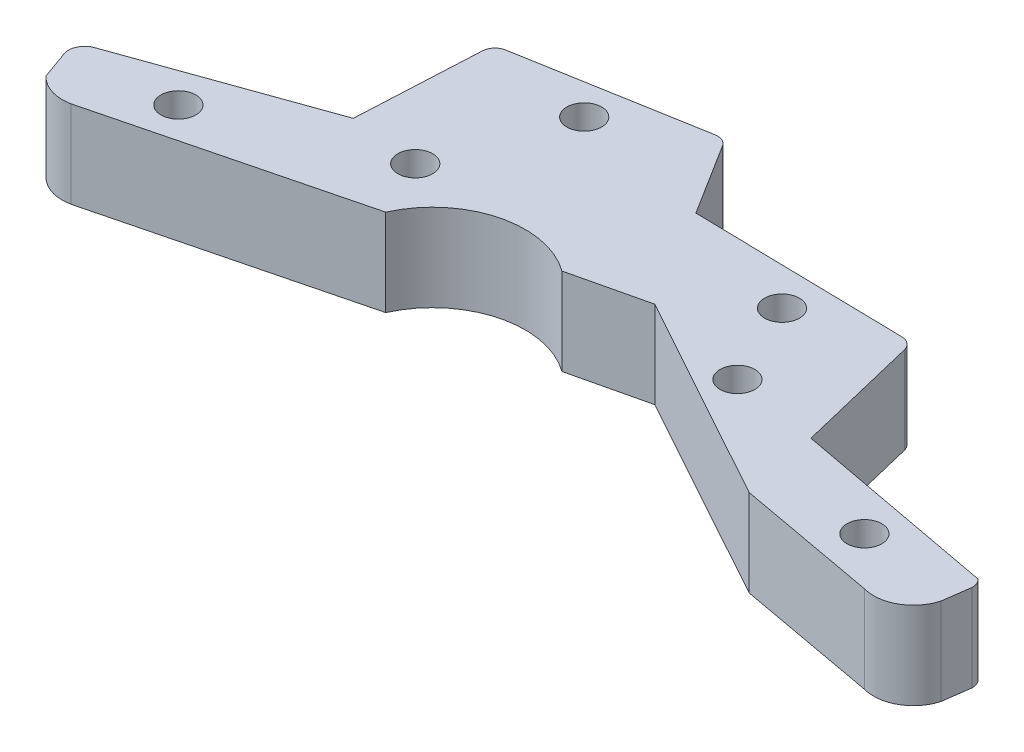
ISO-10303-21;
HEADER;
FILE_DESCRIPTION(('STEP AP214'),'2;1');
FILE_NAME('part.step','',(''),(''),'','','');
FILE_SCHEMA(('AUTOMOTIVE_DESIGN { 1 0 10303 214 1 1 1 1 }'));
ENDSEC;
DATA;
#1=APPLICATION_CONTEXT('core data for automotive mechanical design processes');
#2=APPLICATION_PROTOCOL_DEFINITION('international standard','automotive_design',2000,#1);
#3=PRODUCT_CONTEXT('',#1,'mechanical');
#4=PRODUCT('Part','Part','',(#3));
#5=PRODUCT_RELATED_PRODUCT_CATEGORY('part','',(#4));
#6=PRODUCT_DEFINITION_FORMATION('','',#4);
#7=PRODUCT_DEFINITION_CONTEXT('part definition',#1,'design');
#8=PRODUCT_DEFINITION('design','',#6,#7);
#9=PRODUCT_DEFINITION_SHAPE('','',#8);
#10=(LENGTH_UNIT() NAMED_UNIT(*) SI_UNIT(.MILLI.,.METRE.));
#11=(NAMED_UNIT(*) PLANE_ANGLE_UNIT() SI_UNIT($,.RADIAN.));
#12=(NAMED_UNIT(*) SI_UNIT($,.STERADIAN.) SOLID_ANGLE_UNIT());
#13=UNCERTAINTY_MEASURE_WITH_UNIT(LENGTH_MEASURE(1.E-05),#10,'distance_accuracy_value','');
#14=(GEOMETRIC_REPRESENTATION_CONTEXT(3) GLOBAL_UNCERTAINTY_ASSIGNED_CONTEXT((#13)) GLOBAL_UNIT_ASSIGNED_CONTEXT((#10,
#11,#12)) REPRESENTATION_CONTEXT('',''));
#15=CARTESIAN_POINT('',(0.,0.,0.));
#16=DIRECTION('',(0.,0.,1.));
#17=DIRECTION('',(1.,0.,0.));
#18=AXIS2_PLACEMENT_3D('',#15,#16,#17);
#19=CARTESIAN_POINT('',(-0.289815874706997,5.,-2.51745282339901));
#20=DIRECTION('',(0.,-1.,0.));
#21=DIRECTION('',(0.,0.,-1.));
#22=AXIS2_PLACEMENT_3D('',#19,#20,#21);
#23=PLANE('',#22);
#24=DIRECTION('',(-0.316318024881253,0.,-0.948653206991482));
#25=VECTOR('',#24,1.);
#26=CARTESIAN_POINT('',(37.4882985017171,5.,-12.1989950490083));
#27=LINE('',#26,#25);
#28=CARTESIAN_POINT('',(37.6684219297497,5.,-11.6587960903129));
#29=VERTEX_POINT('',#28);
#30=CARTESIAN_POINT('',(37.6566972295889,5.,-11.6939590387814));
#31=VERTEX_POINT('',#30);
#32=EDGE_CURVE('E414',#29,#31,#27,.T.);
#33=ORIENTED_EDGE('',*,*,#32,.T.);
#34=CARTESIAN_POINT('',(36.9452073243453,5.,-11.4567205201205));
#35=DIRECTION('',(0.,-1.,0.));
#36=DIRECTION('',(0.,0.,-1.));
#37=AXIS2_PLACEMENT_3D('',#34,#35,#36);
#38=CIRCLE('',#37,0.75);
#39=CARTESIAN_POINT('',(36.9600635817865,5.,-12.206573366761));
#40=VERTEX_POINT('',#39);
#41=EDGE_CURVE('E250',#31,#40,#38,.F.);
#42=ORIENTED_EDGE('',*,*,#41,.T.);
#43=DIRECTION('',(-0.999803795520649,0.,-0.0198083432549065));
#44=VECTOR('',#43,1.);
#45=CARTESIAN_POINT('',(24.8825706271916,5.,-12.4458554410791));
#46=LINE('',#45,#44);
#47=CARTESIAN_POINT('',(24.8825706271916,5.,-12.4458554410791));
#48=VERTEX_POINT('',#47);
#49=EDGE_CURVE('E272',#40,#48,#46,.T.);
#50=ORIENTED_EDGE('',*,*,#49,.T.);
#51=DIRECTION('',(-0.531750709089202,0.,-0.846900928906759));
#52=VECTOR('',#51,1.);
#53=CARTESIAN_POINT('',(22.0352622928022,5.,-16.9806647644341));
#54=LINE('',#53,#52);
#55=CARTESIAN_POINT('',(22.3034317533371,5.,-16.5535605568619));
#56=VERTEX_POINT('',#55);
#57=EDGE_CURVE('E266',#48,#56,#54,.T.);
#58=ORIENTED_EDGE('',*,*,#57,.T.);
#59=CARTESIAN_POINT('',(21.6682560566571,5.,-16.154747525045));
#60=DIRECTION('',(0.,-1.,0.));
#61=DIRECTION('',(0.,0.,-1.));
#62=AXIS2_PLACEMENT_3D('',#59,#60,#61);
#63=CIRCLE('',#62,0.75);
#64=CARTESIAN_POINT('',(21.5385473092356,5.,-16.8934461380411));
#65=VERTEX_POINT('',#64);
#66=EDGE_CURVE('E247',#56,#65,#63,.F.);
#67=ORIENTED_EDGE('',*,*,#66,.T.);
#68=DIRECTION('',(-0.984931483994783,0.,0.172944996562013));
#69=VECTOR('',#68,1.);
#70=CARTESIAN_POINT('',(10.7085502268622,5.,-14.9917973039709));
#71=LINE('',#70,#69);
#72=CARTESIAN_POINT('',(11.2979410498949,5.,-15.095288963563));
#73=VERTEX_POINT('',#72);
#74=EDGE_CURVE('E275',#65,#73,#71,.T.);
#75=ORIENTED_EDGE('',*,*,#74,.T.);
#76=CARTESIAN_POINT('',(11.4276497973164,5.,-14.3565903505669));
#77=DIRECTION('',(0.,-1.,0.));
#78=DIRECTION('',(0.,0.,-1.));
#79=AXIS2_PLACEMENT_3D('',#76,#77,#78);
#80=CIRCLE('',#79,0.75);
#81=CARTESIAN_POINT('',(10.678590362017,5.,-14.3941398164592));
#82=VERTEX_POINT('',#81);
#83=EDGE_CURVE('E59',#73,#82,#80,.F.);
#84=ORIENTED_EDGE('',*,*,#83,.T.);
#85=DIRECTION('',(-0.0500659545230991,0.,0.998745913732663));
#86=VECTOR('',#85,1.);
#87=CARTESIAN_POINT('',(10.3238919989922,5.,-7.31840254043886));
#88=LINE('',#87,#86);
#89=CARTESIAN_POINT('',(10.3238919989922,5.,-7.31840254043886));
#90=VERTEX_POINT('',#89);
#91=EDGE_CURVE('E424',#82,#90,#88,.T.);
#92=ORIENTED_EDGE('',*,*,#91,.T.);
#93=DIRECTION('',(-0.941680865702255,0.,0.336507276548741));
#94=VECTOR('',#93,1.);
#95=CARTESIAN_POINT('',(-0.740858173009298,5.,-3.36444204099114));
#96=LINE('',#95,#94);
#97=CARTESIAN_POINT('',(-0.740858173009298,5.,-3.36444204099114));
#98=VERTEX_POINT('',#97);
#99=EDGE_CURVE('E212',#90,#98,#96,.T.);
#100=ORIENTED_EDGE('',*,*,#99,.T.);
#101=CARTESIAN_POINT('',(-0.289815874706997,5.,-2.51745282339901));
#102=DIRECTION('',(0.,1.,0.));
#103=DIRECTION('',(0.,0.,-1.));
#104=AXIS2_PLACEMENT_3D('',#101,#102,#103);
#105=CIRCLE('',#104,0.95959881699347);
#106=CARTESIAN_POINT('',(-1.13680509229922,5.,-2.06641052509663));
#107=VERTEX_POINT('',#106);
#108=EDGE_CURVE('E206',#98,#107,#105,.T.);
#109=ORIENTED_EDGE('',*,*,#108,.T.);
#110=DIRECTION('',(0.336507276548741,0.,0.941680865702255));
#111=VECTOR('',#110,1.);
#112=CARTESIAN_POINT('',(-1.13680509229922,5.,-2.06641052509663));
#113=LINE('',#112,#111);
#114=CARTESIAN_POINT('',(-0.613869143220782,5.,-0.603028269932573));
#115=VERTEX_POINT('',#114);
#116=EDGE_CURVE('E195',#107,#115,#113,.T.);
#117=ORIENTED_EDGE('',*,*,#116,.T.);
#118=CARTESIAN_POINT('',(1.03964284585272,5.,-2.15660573711589));
#119=DIRECTION('',(0.,1.,0.));
#120=DIRECTION('',(0.,0.,1.));
#121=AXIS2_PLACEMENT_3D('',#118,#119,#120);
#122=CIRCLE('',#121,2.26885540406383);
#123=CARTESIAN_POINT('',(1.4922639946117,5.,0.0666438980456126));
#124=VERTEX_POINT('',#123);
#125=EDGE_CURVE('E205',#115,#124,#122,.T.);
#126=ORIENTED_EDGE('',*,*,#125,.T.);
#127=DIRECTION('',(0.969460933159976,0.,-0.24524579318836));
#128=VECTOR('',#127,1.);
#129=CARTESIAN_POINT('',(1.49226399461171,5.,0.0666438980456347));
#130=LINE('',#129,#128);
#131=CARTESIAN_POINT('',(15.9237994237926,5.,-3.58412038981387));
#132=VERTEX_POINT('',#131);
#133=EDGE_CURVE('E357',#124,#132,#130,.T.);
#134=ORIENTED_EDGE('',*,*,#133,.T.);
#135=CARTESIAN_POINT('',(20.7855524338408,5.,-1.40646379990522));
#136=DIRECTION('',(0.,-1.,0.));
#137=DIRECTION('',(0.,0.,-1.));
#138=AXIS2_PLACEMENT_3D('',#135,#136,#137);
#139=CIRCLE('',#138,5.32717847967245);
#140=CARTESIAN_POINT('',(23.9177443627705,5.,-5.71554772513026));
#141=VERTEX_POINT('',#140);
#142=EDGE_CURVE('E436',#132,#141,#139,.T.);
#143=ORIENTED_EDGE('',*,*,#142,.T.);
#144=DIRECTION('',(0.973303545072545,0.,-0.229521696467276));
#145=VECTOR('',#144,1.);
#146=CARTESIAN_POINT('',(23.9177443627705,5.,-5.71554772513026));
#147=LINE('',#146,#145);
#148=CARTESIAN_POINT('',(28.235048802022,5.,-6.73364227957767));
#149=VERTEX_POINT('',#148);
#150=EDGE_CURVE('E441',#141,#149,#147,.T.);
#151=ORIENTED_EDGE('',*,*,#150,.T.);
#152=DIRECTION('',(0.875728977933592,0.,0.482803021124958));
#153=VECTOR('',#152,1.);
#154=CARTESIAN_POINT('',(28.235048802022,5.,-6.73364227957767));
#155=LINE('',#154,#153);
#156=CARTESIAN_POINT('',(40.3139614933497,5.,-0.0743496374198066));
#157=VERTEX_POINT('',#156);
#158=EDGE_CURVE('E444',#149,#157,#155,.T.);
#159=ORIENTED_EDGE('',*,*,#158,.T.);
#160=DIRECTION('',(0.983752587521224,0.,0.1795295144128));
#161=VECTOR('',#160,1.);
#162=CARTESIAN_POINT('',(40.3139614933497,5.,-0.0743496374198066));
#163=LINE('',#162,#161);
#164=CARTESIAN_POINT('',(48.414231820061,5.,1.40390578656962));
#165=VERTEX_POINT('',#164);
#166=EDGE_CURVE('E447',#157,#165,#163,.T.);
#167=ORIENTED_EDGE('',*,*,#166,.T.);
#168=CARTESIAN_POINT('',(49.0249848399915,5.,-0.79727821512559));
#169=DIRECTION('',(0.,1.,0.));
#170=DIRECTION('',(0.,0.,1.));
#171=AXIS2_PLACEMENT_3D('',#168,#169,#170);
#172=CIRCLE('',#171,2.28434460199712);
#173=CARTESIAN_POINT('',(51.2261688416868,5.,-0.186525195195058));
#174=VERTEX_POINT('',#173);
#175=EDGE_CURVE('E450',#165,#174,#172,.T.);
#176=ORIENTED_EDGE('',*,*,#175,.T.);
#177=DIRECTION('',(0.135299827009466,0.,-0.990804701649729));
#178=VECTOR('',#177,1.);
#179=CARTESIAN_POINT('',(51.4411084027788,5.,-1.76053406429394));
#180=LINE('',#179,#178);
#181=CARTESIAN_POINT('',(51.4411084027788,5.,-1.76053406429394));
#182=VERTEX_POINT('',#181);
#183=EDGE_CURVE('E453',#174,#182,#180,.T.);
#184=ORIENTED_EDGE('',*,*,#183,.T.);
#185=CARTESIAN_POINT('',(50.7210477443967,5.,-1.79611534622025));
#186=DIRECTION('',(0.,1.,0.));
#187=DIRECTION('',(0.,0.,-1.));
#188=AXIS2_PLACEMENT_3D('',#185,#186,#187);
#189=CIRCLE('',#188,0.720939234175177);
#190=CARTESIAN_POINT('',(51.1854280410155,5.,-2.34757188982577));
#191=VERTEX_POINT('',#190);
#192=EDGE_CURVE('E456',#182,#191,#189,.T.);
#193=ORIENTED_EDGE('',*,*,#192,.T.);
#194=DIRECTION('',(-0.98304065640601,0.,-0.183387752734038));
#195=VECTOR('',#194,1.);
#196=CARTESIAN_POINT('',(39.3889401641434,5.,-4.54822492263424));
#197=LINE('',#196,#195);
#198=CARTESIAN_POINT('',(39.3889401641434,5.,-4.54822492263424));
#199=VERTEX_POINT('',#198);
#200=EDGE_CURVE('E459',#191,#199,#197,.T.);
#201=ORIENTED_EDGE('',*,*,#200,.T.);
#202=DIRECTION('',(-0.235179565041573,0.,-0.97195193923715));
#203=VECTOR('',#202,1.);
#204=CARTESIAN_POINT('',(37.8177056855201,5.,-11.0418350210469));
#205=LINE('',#204,#203);
#206=EDGE_CURVE('E418',#199,#29,#205,.T.);
#207=ORIENTED_EDGE('',*,*,#206,.T.);
#208=EDGE_LOOP('',(#33,#42,#50,#58,#67,#75,#84,#92,#100,#109,#117,#126,#134,#143,#151,#159,#167,
#176,#184,#193,#201,#207));
#209=FACE_BOUND('',#208,.T.);
#210=CARTESIAN_POINT('',(4.63342315256752,5.,-2.96000893585566));
#211=DIRECTION('',(0.,1.,0.));
#212=DIRECTION('',(0.,0.,1.));
#213=AXIS2_PLACEMENT_3D('',#210,#211,#212);
#214=CIRCLE('',#213,1.);
#215=CARTESIAN_POINT('',(4.63342315256752,5.,-1.96000893585566));
#216=VERTEX_POINT('',#215);
#217=EDGE_CURVE('E430',#216,#216,#214,.T.);
#218=ORIENTED_EDGE('',*,*,#217,.F.);
#219=EDGE_LOOP('',(#218));
#220=FACE_BOUND('',#219,.T.);
#221=CARTESIAN_POINT('',(14.3637575561284,5.,-6.84043430079891));
#222=DIRECTION('',(0.,1.,0.));
#223=DIRECTION('',(0.,0.,1.));
#224=AXIS2_PLACEMENT_3D('',#221,#222,#223);
#225=CIRCLE('',#224,1.);
#226=CARTESIAN_POINT('',(14.3637575561284,5.,-5.84043430079891));
#227=VERTEX_POINT('',#226);
#228=EDGE_CURVE('E863',#227,#227,#225,.T.);
#229=ORIENTED_EDGE('',*,*,#228,.F.);
#230=EDGE_LOOP('',(#229));
#231=FACE_BOUND('',#230,.T.);
#232=CARTESIAN_POINT('',(16.8928658336793,5.,-14.0185639435659));
#233=DIRECTION('',(0.,1.,0.));
#234=DIRECTION('',(0.,0.,1.));
#235=AXIS2_PLACEMENT_3D('',#232,#233,#234);
#236=CIRCLE('',#235,1.);
#237=CARTESIAN_POINT('',(16.8928658336793,5.,-13.0185639435659));
#238=VERTEX_POINT('',#237);
#239=EDGE_CURVE('E855',#238,#238,#236,.T.);
#240=ORIENTED_EDGE('',*,*,#239,.F.);
#241=EDGE_LOOP('',(#240));
#242=FACE_BOUND('',#241,.T.);
#243=CARTESIAN_POINT('',(32.086393370872,5.,-10.1903512330221));
#244=DIRECTION('',(0.,1.,0.));
#245=DIRECTION('',(0.,0.,1.));
#246=AXIS2_PLACEMENT_3D('',#243,#244,#245);
#247=CIRCLE('',#246,0.999999999999998);
#248=CARTESIAN_POINT('',(32.086393370872,5.,-9.19035123302207));
#249=VERTEX_POINT('',#248);
#250=EDGE_CURVE('E847',#249,#249,#247,.T.);
#251=ORIENTED_EDGE('',*,*,#250,.F.);
#252=EDGE_LOOP('',(#251));
#253=FACE_BOUND('',#252,.T.);
#254=CARTESIAN_POINT('',(34.3533418532378,5.,-5.36168395280253));
#255=DIRECTION('',(0.,1.,0.));
#256=DIRECTION('',(0.,0.,1.));
#257=AXIS2_PLACEMENT_3D('',#254,#255,#256);
#258=CIRCLE('',#257,0.999999999999998);
#259=CARTESIAN_POINT('',(34.3533418532378,5.,-4.36168395280254));
#260=VERTEX_POINT('',#259);
#261=EDGE_CURVE('E839',#260,#260,#258,.T.);
#262=ORIENTED_EDGE('',*,*,#261,.F.);
#263=EDGE_LOOP('',(#262));
#264=FACE_BOUND('',#263,.T.);
#265=CARTESIAN_POINT('',(45.6777946968143,5.,-1.33211416248543));
#266=DIRECTION('',(0.,1.,0.));
#267=DIRECTION('',(0.,0.,1.));
#268=AXIS2_PLACEMENT_3D('',#265,#266,#267);
#269=CIRCLE('',#268,0.999999999999998);
#270=CARTESIAN_POINT('',(45.6777946968143,5.,-0.33211416248543));
#271=VERTEX_POINT('',#270);
#272=EDGE_CURVE('E828',#271,#271,#269,.T.);
#273=ORIENTED_EDGE('',*,*,#272,.F.);
#274=EDGE_LOOP('',(#273));
#275=FACE_BOUND('',#274,.T.);
#276=ADVANCED_FACE('F43',(#209,#220,#231,#242,#253,#264,#275),#23,.F.);
#277=CARTESIAN_POINT('',(-0.289815874706997,0.,-2.51745282339901));
#278=DIRECTION('',(0.,-1.,0.));
#279=DIRECTION('',(0.,0.,-1.));
#280=AXIS2_PLACEMENT_3D('',#277,#278,#279);
#281=PLANE('',#280);
#282=CARTESIAN_POINT('',(34.3533418532378,0.,-5.36168395280253));
#283=DIRECTION('',(0.,1.,0.));
#284=DIRECTION('',(0.,0.,1.));
#285=AXIS2_PLACEMENT_3D('',#282,#283,#284);
#286=CIRCLE('',#285,0.999999999999998);
#287=CARTESIAN_POINT('',(34.3533418532378,0.,-4.36168395280254));
#288=VERTEX_POINT('',#287);
#289=EDGE_CURVE('E836',#288,#288,#286,.T.);
#290=ORIENTED_EDGE('',*,*,#289,.T.);
#291=EDGE_LOOP('',(#290));
#292=FACE_BOUND('',#291,.T.);
#293=CARTESIAN_POINT('',(16.8928658336793,0.,-14.0185639435659));
#294=DIRECTION('',(0.,1.,0.));
#295=DIRECTION('',(0.,0.,1.));
#296=AXIS2_PLACEMENT_3D('',#293,#294,#295);
#297=CIRCLE('',#296,1.);
#298=CARTESIAN_POINT('',(16.8928658336793,0.,-13.0185639435659));
#299=VERTEX_POINT('',#298);
#300=EDGE_CURVE('E851',#299,#299,#297,.T.);
#301=ORIENTED_EDGE('',*,*,#300,.T.);
#302=EDGE_LOOP('',(#301));
#303=FACE_BOUND('',#302,.T.);
#304=CARTESIAN_POINT('',(4.63342315256752,0.,-2.96000893585566));
#305=DIRECTION('',(0.,1.,0.));
#306=DIRECTION('',(0.,0.,1.));
#307=AXIS2_PLACEMENT_3D('',#304,#305,#306);
#308=CIRCLE('',#307,1.);
#309=CARTESIAN_POINT('',(4.63342315256752,0.,-1.96000893585566));
#310=VERTEX_POINT('',#309);
#311=EDGE_CURVE('E867',#310,#310,#308,.T.);
#312=ORIENTED_EDGE('',*,*,#311,.T.);
#313=EDGE_LOOP('',(#312));
#314=FACE_BOUND('',#313,.T.);
#315=DIRECTION('',(-0.999803795520649,0.,-0.0198083432549065));
#316=VECTOR('',#315,1.);
#317=CARTESIAN_POINT('',(24.8825706271916,0.,-12.4458554410791));
#318=LINE('',#317,#316);
#319=CARTESIAN_POINT('',(36.9600635817865,0.,-12.206573366761));
#320=VERTEX_POINT('',#319);
#321=CARTESIAN_POINT('',(24.8825706271916,0.,-12.4458554410791));
#322=VERTEX_POINT('',#321);
#323=EDGE_CURVE('E293',#320,#322,#318,.T.);
#324=ORIENTED_EDGE('',*,*,#323,.F.);
#325=CARTESIAN_POINT('',(36.9452073243453,0.,-11.4567205201205));
#326=DIRECTION('',(0.,-1.,0.));
#327=DIRECTION('',(0.,0.,-1.));
#328=AXIS2_PLACEMENT_3D('',#325,#326,#327);
#329=CIRCLE('',#328,0.75);
#330=CARTESIAN_POINT('',(37.6566972295889,0.,-11.6939590387814));
#331=VERTEX_POINT('',#330);
#332=EDGE_CURVE('E239',#320,#331,#329,.T.);
#333=ORIENTED_EDGE('',*,*,#332,.T.);
#334=DIRECTION('',(-0.316318024881253,0.,-0.948653206991482));
#335=VECTOR('',#334,1.);
#336=CARTESIAN_POINT('',(37.4882985017171,0.,-12.1989950490083));
#337=LINE('',#336,#335);
#338=CARTESIAN_POINT('',(37.6684219297497,0.,-11.6587960903129));
#339=VERTEX_POINT('',#338);
#340=EDGE_CURVE('E398',#339,#331,#337,.T.);
#341=ORIENTED_EDGE('',*,*,#340,.F.);
#342=DIRECTION('',(-0.235179565041571,0.,-0.97195193923715));
#343=VECTOR('',#342,1.);
#344=CARTESIAN_POINT('',(37.8177056855201,0.,-11.0418350210469));
#345=LINE('',#344,#343);
#346=CARTESIAN_POINT('',(39.3889401641434,0.,-4.54822492263424));
#347=VERTEX_POINT('',#346);
#348=EDGE_CURVE('E395',#347,#339,#345,.T.);
#349=ORIENTED_EDGE('',*,*,#348,.F.);
#350=DIRECTION('',(-0.98304065640601,0.,-0.183387752734038));
#351=VECTOR('',#350,1.);
#352=CARTESIAN_POINT('',(39.3889401641434,0.,-4.54822492263424));
#353=LINE('',#352,#351);
#354=CARTESIAN_POINT('',(51.1854280410155,0.,-2.34757188982577));
#355=VERTEX_POINT('',#354);
#356=EDGE_CURVE('E391',#355,#347,#353,.T.);
#357=ORIENTED_EDGE('',*,*,#356,.F.);
#358=CARTESIAN_POINT('',(50.7210477443967,0.,-1.79611534622025));
#359=DIRECTION('',(0.,1.,0.));
#360=DIRECTION('',(0.,0.,-1.));
#361=AXIS2_PLACEMENT_3D('',#358,#359,#360);
#362=CIRCLE('',#361,0.720939234175177);
#363=CARTESIAN_POINT('',(51.4411084027788,0.,-1.76053406429394));
#364=VERTEX_POINT('',#363);
#365=EDGE_CURVE('E388',#364,#355,#362,.T.);
#366=ORIENTED_EDGE('',*,*,#365,.F.);
#367=DIRECTION('',(0.135299827009466,0.,-0.990804701649729));
#368=VECTOR('',#367,1.);
#369=CARTESIAN_POINT('',(51.4411084027788,0.,-1.76053406429394));
#370=LINE('',#369,#368);
#371=CARTESIAN_POINT('',(51.2261688416868,0.,-0.186525195195058));
#372=VERTEX_POINT('',#371);
#373=EDGE_CURVE('E385',#372,#364,#370,.T.);
#374=ORIENTED_EDGE('',*,*,#373,.F.);
#375=CARTESIAN_POINT('',(49.0249848399915,0.,-0.79727821512559));
#376=DIRECTION('',(0.,1.,0.));
#377=DIRECTION('',(0.,0.,1.));
#378=AXIS2_PLACEMENT_3D('',#375,#376,#377);
#379=CIRCLE('',#378,2.28434460199712);
#380=CARTESIAN_POINT('',(48.414231820061,0.,1.40390578656962));
#381=VERTEX_POINT('',#380);
#382=EDGE_CURVE('E382',#381,#372,#379,.T.);
#383=ORIENTED_EDGE('',*,*,#382,.F.);
#384=DIRECTION('',(0.983752587521224,0.,0.1795295144128));
#385=VECTOR('',#384,1.);
#386=CARTESIAN_POINT('',(40.3139614933497,0.,-0.0743496374198066));
#387=LINE('',#386,#385);
#388=CARTESIAN_POINT('',(40.3139614933497,0.,-0.0743496374198066));
#389=VERTEX_POINT('',#388);
#390=EDGE_CURVE('E379',#389,#381,#387,.T.);
#391=ORIENTED_EDGE('',*,*,#390,.F.);
#392=DIRECTION('',(0.875728977933592,0.,0.482803021124958));
#393=VECTOR('',#392,1.);
#394=CARTESIAN_POINT('',(28.235048802022,0.,-6.73364227957767));
#395=LINE('',#394,#393);
#396=CARTESIAN_POINT('',(28.235048802022,0.,-6.73364227957767));
#397=VERTEX_POINT('',#396);
#398=EDGE_CURVE('E376',#397,#389,#395,.T.);
#399=ORIENTED_EDGE('',*,*,#398,.F.);
#400=DIRECTION('',(0.973303545072545,0.,-0.229521696467276));
#401=VECTOR('',#400,1.);
#402=CARTESIAN_POINT('',(23.9177443627705,0.,-5.71554772513026));
#403=LINE('',#402,#401);
#404=CARTESIAN_POINT('',(23.9177443627705,0.,-5.71554772513026));
#405=VERTEX_POINT('',#404);
#406=EDGE_CURVE('E368',#405,#397,#403,.T.);
#407=ORIENTED_EDGE('',*,*,#406,.F.);
#408=CARTESIAN_POINT('',(20.7855524338408,0.,-1.40646379990522));
#409=DIRECTION('',(0.,-1.,0.));
#410=DIRECTION('',(0.,0.,-1.));
#411=AXIS2_PLACEMENT_3D('',#408,#409,#410);
#412=CIRCLE('',#411,5.32717847967245);
#413=CARTESIAN_POINT('',(15.9237994237926,0.,-3.58412038981387));
#414=VERTEX_POINT('',#413);
#415=EDGE_CURVE('E363',#414,#405,#412,.T.);
#416=ORIENTED_EDGE('',*,*,#415,.F.);
#417=DIRECTION('',(0.969460933159976,0.,-0.24524579318836));
#418=VECTOR('',#417,1.);
#419=CARTESIAN_POINT('',(1.49226399461171,0.,0.0666438980456347));
#420=LINE('',#419,#418);
#421=CARTESIAN_POINT('',(1.4922639946117,0.,0.0666438980456126));
#422=VERTEX_POINT('',#421);
#423=EDGE_CURVE('E356',#422,#414,#420,.T.);
#424=ORIENTED_EDGE('',*,*,#423,.F.);
#425=CARTESIAN_POINT('',(1.03964284585272,0.,-2.15660573711589));
#426=DIRECTION('',(0.,1.,0.));
#427=DIRECTION('',(0.,0.,1.));
#428=AXIS2_PLACEMENT_3D('',#425,#426,#427);
#429=CIRCLE('',#428,2.26885540406383);
#430=CARTESIAN_POINT('',(-0.613869143220782,0.,-0.603028269932573));
#431=VERTEX_POINT('',#430);
#432=EDGE_CURVE('E361',#431,#422,#429,.T.);
#433=ORIENTED_EDGE('',*,*,#432,.F.);
#434=DIRECTION('',(0.336507276548741,0.,0.941680865702255));
#435=VECTOR('',#434,1.);
#436=CARTESIAN_POINT('',(-1.13680509229922,0.,-2.06641052509663));
#437=LINE('',#436,#435);
#438=CARTESIAN_POINT('',(-1.13680509229922,0.,-2.06641052509663));
#439=VERTEX_POINT('',#438);
#440=EDGE_CURVE('E370',#439,#431,#437,.T.);
#441=ORIENTED_EDGE('',*,*,#440,.F.);
#442=CARTESIAN_POINT('',(-0.289815874706997,0.,-2.51745282339901));
#443=DIRECTION('',(0.,1.,0.));
#444=DIRECTION('',(0.,0.,-1.));
#445=AXIS2_PLACEMENT_3D('',#442,#443,#444);
#446=CIRCLE('',#445,0.95959881699347);
#447=CARTESIAN_POINT('',(-0.740858173009298,0.,-3.36444204099114));
#448=VERTEX_POINT('',#447);
#449=EDGE_CURVE('E221',#448,#439,#446,.T.);
#450=ORIENTED_EDGE('',*,*,#449,.F.);
#451=DIRECTION('',(-0.941680865702255,0.,0.336507276548741));
#452=VECTOR('',#451,1.);
#453=CARTESIAN_POINT('',(-0.740858173009298,0.,-3.36444204099114));
#454=LINE('',#453,#452);
#455=CARTESIAN_POINT('',(10.3238919989922,0.,-7.31840254043886));
#456=VERTEX_POINT('',#455);
#457=EDGE_CURVE('E217',#456,#448,#454,.T.);
#458=ORIENTED_EDGE('',*,*,#457,.F.);
#459=DIRECTION('',(-0.0500659545230991,0.,0.998745913732663));
#460=VECTOR('',#459,1.);
#461=CARTESIAN_POINT('',(10.3238919989922,0.,-7.31840254043886));
#462=LINE('',#461,#460);
#463=CARTESIAN_POINT('',(10.678590362017,0.,-14.3941398164592));
#464=VERTEX_POINT('',#463);
#465=EDGE_CURVE('E288',#464,#456,#462,.T.);
#466=ORIENTED_EDGE('',*,*,#465,.F.);
#467=CARTESIAN_POINT('',(11.4276497973164,0.,-14.3565903505669));
#468=DIRECTION('',(0.,-1.,0.));
#469=DIRECTION('',(0.,0.,-1.));
#470=AXIS2_PLACEMENT_3D('',#467,#468,#469);
#471=CIRCLE('',#470,0.75);
#472=CARTESIAN_POINT('',(11.2979410498949,0.,-15.095288963563));
#473=VERTEX_POINT('',#472);
#474=EDGE_CURVE('E228',#464,#473,#471,.T.);
#475=ORIENTED_EDGE('',*,*,#474,.T.);
#476=DIRECTION('',(-0.984931483994783,0.,0.172944996562013));
#477=VECTOR('',#476,1.);
#478=CARTESIAN_POINT('',(10.7085502268622,0.,-14.9917973039709));
#479=LINE('',#478,#477);
#480=CARTESIAN_POINT('',(21.5385473092356,0.,-16.8934461380411));
#481=VERTEX_POINT('',#480);
#482=EDGE_CURVE('E281',#481,#473,#479,.T.);
#483=ORIENTED_EDGE('',*,*,#482,.F.);
#484=CARTESIAN_POINT('',(21.6682560566571,0.,-16.154747525045));
#485=DIRECTION('',(0.,-1.,0.));
#486=DIRECTION('',(0.,0.,-1.));
#487=AXIS2_PLACEMENT_3D('',#484,#485,#486);
#488=CIRCLE('',#487,0.75);
#489=CARTESIAN_POINT('',(22.3034317533371,0.,-16.5535605568619));
#490=VERTEX_POINT('',#489);
#491=EDGE_CURVE('E236',#481,#490,#488,.T.);
#492=ORIENTED_EDGE('',*,*,#491,.T.);
#493=DIRECTION('',(-0.531750709089202,0.,-0.846900928906759));
#494=VECTOR('',#493,1.);
#495=CARTESIAN_POINT('',(22.0352622928022,0.,-16.9806647644341));
#496=LINE('',#495,#494);
#497=EDGE_CURVE('E268',#322,#490,#496,.T.);
#498=ORIENTED_EDGE('',*,*,#497,.F.);
#499=EDGE_LOOP('',(#324,#333,#341,#349,#357,#366,#374,#383,#391,#399,#407,#416,#424,#433,#441,
#450,#458,#466,#475,#483,#492,#498));
#500=FACE_BOUND('',#499,.T.);
#501=CARTESIAN_POINT('',(14.3637575561284,0.,-6.84043430079891));
#502=DIRECTION('',(0.,1.,0.));
#503=DIRECTION('',(0.,0.,1.));
#504=AXIS2_PLACEMENT_3D('',#501,#502,#503);
#505=CIRCLE('',#504,1.);
#506=CARTESIAN_POINT('',(14.3637575561284,0.,-5.84043430079891));
#507=VERTEX_POINT('',#506);
#508=EDGE_CURVE('E859',#507,#507,#505,.T.);
#509=ORIENTED_EDGE('',*,*,#508,.T.);
#510=EDGE_LOOP('',(#509));
#511=FACE_BOUND('',#510,.T.);
#512=CARTESIAN_POINT('',(32.086393370872,0.,-10.1903512330221));
#513=DIRECTION('',(0.,1.,0.));
#514=DIRECTION('',(0.,0.,1.));
#515=AXIS2_PLACEMENT_3D('',#512,#513,#514);
#516=CIRCLE('',#515,0.999999999999998);
#517=CARTESIAN_POINT('',(32.086393370872,0.,-9.19035123302207));
#518=VERTEX_POINT('',#517);
#519=EDGE_CURVE('E843',#518,#518,#516,.T.);
#520=ORIENTED_EDGE('',*,*,#519,.T.);
#521=EDGE_LOOP('',(#520));
#522=FACE_BOUND('',#521,.T.);
#523=CARTESIAN_POINT('',(45.6777946968143,0.,-1.33211416248543));
#524=DIRECTION('',(0.,1.,0.));
#525=DIRECTION('',(0.,0.,1.));
#526=AXIS2_PLACEMENT_3D('',#523,#524,#525);
#527=CIRCLE('',#526,0.999999999999998);
#528=CARTESIAN_POINT('',(45.6777946968143,0.,-0.33211416248543));
#529=VERTEX_POINT('',#528);
#530=EDGE_CURVE('E831',#529,#529,#527,.T.);
#531=ORIENTED_EDGE('',*,*,#530,.T.);
#532=EDGE_LOOP('',(#531));
#533=FACE_BOUND('',#532,.T.);
#534=ADVANCED_FACE('F284',(#292,#303,#314,#500,#511,#522,#533),#281,.T.);
#535=CARTESIAN_POINT('',(-0.289815874706997,5.,-2.51745282339901));
#536=DIRECTION('',(0.,-1.,0.));
#537=DIRECTION('',(0.,0.,-1.));
#538=AXIS2_PLACEMENT_3D('',#535,#536,#537);
#539=CYLINDRICAL_SURFACE('',#538,0.95959881699347);
#540=ORIENTED_EDGE('',*,*,#449,.T.);
#541=DIRECTION('',(0.,-1.,0.));
#542=VECTOR('',#541,1.);
#543=CARTESIAN_POINT('',(-1.13680509229922,5.,-2.06641052509663));
#544=LINE('',#543,#542);
#545=EDGE_CURVE('E199',#107,#439,#544,.T.);
#546=ORIENTED_EDGE('',*,*,#545,.F.);
#547=ORIENTED_EDGE('',*,*,#108,.F.);
#548=DIRECTION('',(0.,-1.,0.));
#549=VECTOR('',#548,1.);
#550=CARTESIAN_POINT('',(-0.740858173009298,5.,-3.36444204099114));
#551=LINE('',#550,#549);
#552=EDGE_CURVE('E299',#98,#448,#551,.T.);
#553=ORIENTED_EDGE('',*,*,#552,.T.);
#554=EDGE_LOOP('',(#540,#546,#547,#553));
#555=FACE_BOUND('',#554,.T.);
#556=ADVANCED_FACE('F219',(#555),#539,.T.);
#557=CARTESIAN_POINT('',(-1.13680509229922,5.,-2.06641052509663));
#558=DIRECTION('',(0.941680865702255,0.,-0.336507276548741));
#559=DIRECTION('',(-0.336507276548741,0.,-0.941680865702255));
#560=AXIS2_PLACEMENT_3D('',#557,#558,#559);
#561=PLANE('',#560);
#562=ORIENTED_EDGE('',*,*,#440,.T.);
#563=DIRECTION('',(0.,-1.,0.));
#564=VECTOR('',#563,1.);
#565=CARTESIAN_POINT('',(-0.613869143220782,5.,-0.603028269932573));
#566=LINE('',#565,#564);
#567=EDGE_CURVE('E202',#115,#431,#566,.T.);
#568=ORIENTED_EDGE('',*,*,#567,.F.);
#569=ORIENTED_EDGE('',*,*,#116,.F.);
#570=ORIENTED_EDGE('',*,*,#545,.T.);
#571=EDGE_LOOP('',(#562,#568,#569,#570));
#572=FACE_BOUND('',#571,.T.);
#573=ADVANCED_FACE('F197',(#572),#561,.F.);
#574=CARTESIAN_POINT('',(1.03964284585272,5.,-2.15660573711589));
#575=DIRECTION('',(0.,-1.,0.));
#576=DIRECTION('',(0.,0.,-1.));
#577=AXIS2_PLACEMENT_3D('',#574,#575,#576);
#578=CYLINDRICAL_SURFACE('',#577,2.26885540406383);
#579=ORIENTED_EDGE('',*,*,#432,.T.);
#580=DIRECTION('',(0.,-1.,0.));
#581=VECTOR('',#580,1.);
#582=CARTESIAN_POINT('',(1.4922639946117,5.,0.0666438980456126));
#583=LINE('',#582,#581);
#584=EDGE_CURVE('E230',#124,#422,#583,.T.);
#585=ORIENTED_EDGE('',*,*,#584,.F.);
#586=ORIENTED_EDGE('',*,*,#125,.F.);
#587=ORIENTED_EDGE('',*,*,#567,.T.);
#588=EDGE_LOOP('',(#579,#585,#586,#587));
#589=FACE_BOUND('',#588,.T.);
#590=ADVANCED_FACE('F432',(#589),#578,.T.);
#591=CARTESIAN_POINT('',(1.49226399461171,5.,0.0666438980456347));
#592=DIRECTION('',(-0.24524579318836,0.,-0.969460933159976));
#593=DIRECTION('',(-0.969460933159976,0.,0.24524579318836));
#594=AXIS2_PLACEMENT_3D('',#591,#592,#593);
#595=PLANE('',#594);
#596=ORIENTED_EDGE('',*,*,#423,.T.);
#597=DIRECTION('',(0.,-1.,0.));
#598=VECTOR('',#597,1.);
#599=CARTESIAN_POINT('',(15.9237994237926,5.,-3.58412038981387));
#600=LINE('',#599,#598);
#601=EDGE_CURVE('E345',#132,#414,#600,.T.);
#602=ORIENTED_EDGE('',*,*,#601,.F.);
#603=ORIENTED_EDGE('',*,*,#133,.F.);
#604=ORIENTED_EDGE('',*,*,#584,.T.);
#605=EDGE_LOOP('',(#596,#602,#603,#604));
#606=FACE_BOUND('',#605,.T.);
#607=ADVANCED_FACE('F354',(#606),#595,.F.);
#608=CARTESIAN_POINT('',(20.7855524338408,5.,-1.40646379990522));
#609=DIRECTION('',(0.,-1.,0.));
#610=DIRECTION('',(0.,0.,-1.));
#611=AXIS2_PLACEMENT_3D('',#608,#609,#610);
#612=CYLINDRICAL_SURFACE('',#611,5.32717847967245);
#613=ORIENTED_EDGE('',*,*,#415,.T.);
#614=DIRECTION('',(0.,-1.,0.));
#615=VECTOR('',#614,1.);
#616=CARTESIAN_POINT('',(23.9177443627705,5.,-5.71554772513026));
#617=LINE('',#616,#615);
#618=EDGE_CURVE('E341',#141,#405,#617,.T.);
#619=ORIENTED_EDGE('',*,*,#618,.F.);
#620=ORIENTED_EDGE('',*,*,#142,.F.);
#621=ORIENTED_EDGE('',*,*,#601,.T.);
#622=EDGE_LOOP('',(#613,#619,#620,#621));
#623=FACE_BOUND('',#622,.T.);
#624=ADVANCED_FACE('F502',(#623),#612,.F.);
#625=CARTESIAN_POINT('',(23.9177443627705,5.,-5.71554772513026));
#626=DIRECTION('',(-0.229521696467276,0.,-0.973303545072545));
#627=DIRECTION('',(-0.973303545072545,0.,0.229521696467276));
#628=AXIS2_PLACEMENT_3D('',#625,#626,#627);
#629=PLANE('',#628);
#630=ORIENTED_EDGE('',*,*,#406,.T.);
#631=DIRECTION('',(0.,-1.,0.));
#632=VECTOR('',#631,1.);
#633=CARTESIAN_POINT('',(28.235048802022,5.,-6.73364227957767));
#634=LINE('',#633,#632);
#635=EDGE_CURVE('E337',#149,#397,#634,.T.);
#636=ORIENTED_EDGE('',*,*,#635,.F.);
#637=ORIENTED_EDGE('',*,*,#150,.F.);
#638=ORIENTED_EDGE('',*,*,#618,.T.);
#639=EDGE_LOOP('',(#630,#636,#637,#638));
#640=FACE_BOUND('',#639,.T.);
#641=ADVANCED_FACE('F498',(#640),#629,.F.);
#642=CARTESIAN_POINT('',(28.235048802022,5.,-6.73364227957767));
#643=DIRECTION('',(0.482803021124958,0.,-0.875728977933592));
#644=DIRECTION('',(-0.875728977933592,0.,-0.482803021124958));
#645=AXIS2_PLACEMENT_3D('',#642,#643,#644);
#646=PLANE('',#645);
#647=ORIENTED_EDGE('',*,*,#398,.T.);
#648=DIRECTION('',(0.,-1.,0.));
#649=VECTOR('',#648,1.);
#650=CARTESIAN_POINT('',(40.3139614933497,5.,-0.0743496374198066));
#651=LINE('',#650,#649);
#652=EDGE_CURVE('E333',#157,#389,#651,.T.);
#653=ORIENTED_EDGE('',*,*,#652,.F.);
#654=ORIENTED_EDGE('',*,*,#158,.F.);
#655=ORIENTED_EDGE('',*,*,#635,.T.);
#656=EDGE_LOOP('',(#647,#653,#654,#655));
#657=FACE_BOUND('',#656,.T.);
#658=ADVANCED_FACE('F493',(#657),#646,.F.);
#659=CARTESIAN_POINT('',(40.3139614933497,5.,-0.0743496374198066));
#660=DIRECTION('',(0.1795295144128,0.,-0.983752587521224));
#661=DIRECTION('',(-0.983752587521224,0.,-0.1795295144128));
#662=AXIS2_PLACEMENT_3D('',#659,#660,#661);
#663=PLANE('',#662);
#664=ORIENTED_EDGE('',*,*,#390,.T.);
#665=DIRECTION('',(0.,-1.,0.));
#666=VECTOR('',#665,1.);
#667=CARTESIAN_POINT('',(48.414231820061,5.,1.40390578656962));
#668=LINE('',#667,#666);
#669=EDGE_CURVE('E329',#165,#381,#668,.T.);
#670=ORIENTED_EDGE('',*,*,#669,.F.);
#671=ORIENTED_EDGE('',*,*,#166,.F.);
#672=ORIENTED_EDGE('',*,*,#652,.T.);
#673=EDGE_LOOP('',(#664,#670,#671,#672));
#674=FACE_BOUND('',#673,.T.);
#675=ADVANCED_FACE('F489',(#674),#663,.F.);
#676=CARTESIAN_POINT('',(49.0249848399915,5.,-0.79727821512559));
#677=DIRECTION('',(0.,-1.,0.));
#678=DIRECTION('',(0.,0.,-1.));
#679=AXIS2_PLACEMENT_3D('',#676,#677,#678);
#680=CYLINDRICAL_SURFACE('',#679,2.28434460199712);
#681=ORIENTED_EDGE('',*,*,#382,.T.);
#682=DIRECTION('',(0.,-1.,0.));
#683=VECTOR('',#682,1.);
#684=CARTESIAN_POINT('',(51.2261688416868,5.,-0.186525195195058));
#685=LINE('',#684,#683);
#686=EDGE_CURVE('E325',#174,#372,#685,.T.);
#687=ORIENTED_EDGE('',*,*,#686,.F.);
#688=ORIENTED_EDGE('',*,*,#175,.F.);
#689=ORIENTED_EDGE('',*,*,#669,.T.);
#690=EDGE_LOOP('',(#681,#687,#688,#689));
#691=FACE_BOUND('',#690,.T.);
#692=ADVANCED_FACE('F485',(#691),#680,.T.);
#693=CARTESIAN_POINT('',(51.4411084027788,5.,-1.76053406429394));
#694=DIRECTION('',(-0.990804701649729,0.,-0.135299827009466));
#695=DIRECTION('',(-0.135299827009466,0.,0.990804701649729));
#696=AXIS2_PLACEMENT_3D('',#693,#694,#695);
#697=PLANE('',#696);
#698=ORIENTED_EDGE('',*,*,#373,.T.);
#699=DIRECTION('',(0.,-1.,0.));
#700=VECTOR('',#699,1.);
#701=CARTESIAN_POINT('',(51.4411084027788,5.,-1.76053406429394));
#702=LINE('',#701,#700);
#703=EDGE_CURVE('E321',#182,#364,#702,.T.);
#704=ORIENTED_EDGE('',*,*,#703,.F.);
#705=ORIENTED_EDGE('',*,*,#183,.F.);
#706=ORIENTED_EDGE('',*,*,#686,.T.);
#707=EDGE_LOOP('',(#698,#704,#705,#706));
#708=FACE_BOUND('',#707,.T.);
#709=ADVANCED_FACE('F480',(#708),#697,.F.);
#710=CARTESIAN_POINT('',(50.7210477443967,5.,-1.79611534622025));
#711=DIRECTION('',(0.,-1.,0.));
#712=DIRECTION('',(0.,0.,-1.));
#713=AXIS2_PLACEMENT_3D('',#710,#711,#712);
#714=CYLINDRICAL_SURFACE('',#713,0.720939234175177);
#715=ORIENTED_EDGE('',*,*,#365,.T.);
#716=DIRECTION('',(0.,-1.,0.));
#717=VECTOR('',#716,1.);
#718=CARTESIAN_POINT('',(51.1854280410155,5.,-2.34757188982577));
#719=LINE('',#718,#717);
#720=EDGE_CURVE('E317',#191,#355,#719,.T.);
#721=ORIENTED_EDGE('',*,*,#720,.F.);
#722=ORIENTED_EDGE('',*,*,#192,.F.);
#723=ORIENTED_EDGE('',*,*,#703,.T.);
#724=EDGE_LOOP('',(#715,#721,#722,#723));
#725=FACE_BOUND('',#724,.T.);
#726=ADVANCED_FACE('F474',(#725),#714,.T.);
#727=CARTESIAN_POINT('',(39.3889401641434,5.,-4.54822492263424));
#728=DIRECTION('',(-0.183387752734038,0.,0.98304065640601));
#729=DIRECTION('',(0.98304065640601,0.,0.183387752734038));
#730=AXIS2_PLACEMENT_3D('',#727,#728,#729);
#731=PLANE('',#730);
#732=ORIENTED_EDGE('',*,*,#356,.T.);
#733=DIRECTION('',(0.,-1.,0.));
#734=VECTOR('',#733,1.);
#735=CARTESIAN_POINT('',(39.3889401641434,5.,-4.54822492263424));
#736=LINE('',#735,#734);
#737=EDGE_CURVE('E313',#199,#347,#736,.T.);
#738=ORIENTED_EDGE('',*,*,#737,.F.);
#739=ORIENTED_EDGE('',*,*,#200,.F.);
#740=ORIENTED_EDGE('',*,*,#720,.T.);
#741=EDGE_LOOP('',(#732,#738,#739,#740));
#742=FACE_BOUND('',#741,.T.);
#743=ADVANCED_FACE('F470',(#742),#731,.F.);
#744=CARTESIAN_POINT('',(37.8177056855201,5.,-11.0418350210469));
#745=DIRECTION('',(-0.97195193923715,0.,0.235179565041571));
#746=DIRECTION('',(0.235179565041571,0.,0.971951939237151));
#747=AXIS2_PLACEMENT_3D('',#744,#745,#746);
#748=PLANE('',#747);
#749=ORIENTED_EDGE('',*,*,#348,.T.);
#750=DIRECTION('',(0.,-1.,0.));
#751=VECTOR('',#750,1.);
#752=CARTESIAN_POINT('',(37.6684219297497,5.,-11.6587960903129));
#753=LINE('',#752,#751);
#754=EDGE_CURVE('E309',#29,#339,#753,.T.);
#755=ORIENTED_EDGE('',*,*,#754,.F.);
#756=ORIENTED_EDGE('',*,*,#206,.F.);
#757=ORIENTED_EDGE('',*,*,#737,.T.);
#758=EDGE_LOOP('',(#749,#755,#756,#757));
#759=FACE_BOUND('',#758,.T.);
#760=ADVANCED_FACE('F466',(#759),#748,.F.);
#761=CARTESIAN_POINT('',(37.4882985017171,5.,-12.1989950490083));
#762=DIRECTION('',(-0.948653206991482,0.,0.316318024881253));
#763=DIRECTION('',(0.316318024881253,0.,0.948653206991482));
#764=AXIS2_PLACEMENT_3D('',#761,#762,#763);
#765=PLANE('',#764);
#766=ORIENTED_EDGE('',*,*,#340,.T.);
#767=DIRECTION('',(0.,-1.,0.));
#768=VECTOR('',#767,1.);
#769=CARTESIAN_POINT('',(37.6566972295889,5.,-11.6939590387814));
#770=LINE('',#769,#768);
#771=EDGE_CURVE('E242',#331,#31,#770,.F.);
#772=ORIENTED_EDGE('',*,*,#771,.T.);
#773=ORIENTED_EDGE('',*,*,#32,.F.);
#774=ORIENTED_EDGE('',*,*,#754,.T.);
#775=EDGE_LOOP('',(#766,#772,#773,#774));
#776=FACE_BOUND('',#775,.T.);
#777=ADVANCED_FACE('F409',(#776),#765,.F.);
#778=CARTESIAN_POINT('',(24.8825706271916,5.,-12.4458554410791));
#779=DIRECTION('',(-0.0198083432549065,0.,0.999803795520649));
#780=DIRECTION('',(0.999803795520649,0.,0.0198083432549065));
#781=AXIS2_PLACEMENT_3D('',#778,#779,#780);
#782=PLANE('',#781);
#783=ORIENTED_EDGE('',*,*,#49,.F.);
#784=DIRECTION('',(0.,-1.,0.));
#785=VECTOR('',#784,1.);
#786=CARTESIAN_POINT('',(36.9600635817865,5.,-12.206573366761));
#787=LINE('',#786,#785);
#788=EDGE_CURVE('E223',#40,#320,#787,.T.);
#789=ORIENTED_EDGE('',*,*,#788,.T.);
#790=ORIENTED_EDGE('',*,*,#323,.T.);
#791=DIRECTION('',(0.,-1.,0.));
#792=VECTOR('',#791,1.);
#793=CARTESIAN_POINT('',(24.8825706271916,5.,-12.4458554410791));
#794=LINE('',#793,#792);
#795=EDGE_CURVE('E306',#48,#322,#794,.T.);
#796=ORIENTED_EDGE('',*,*,#795,.F.);
#797=EDGE_LOOP('',(#783,#789,#790,#796));
#798=FACE_BOUND('',#797,.T.);
#799=ADVANCED_FACE('F403',(#798),#782,.F.);
#800=CARTESIAN_POINT('',(22.0352622928022,5.,-16.9806647644341));
#801=DIRECTION('',(-0.846900928906759,0.,0.531750709089202));
#802=DIRECTION('',(0.531750709089202,0.,0.846900928906759));
#803=AXIS2_PLACEMENT_3D('',#800,#801,#802);
#804=PLANE('',#803);
#805=ORIENTED_EDGE('',*,*,#497,.T.);
#806=DIRECTION('',(0.,-1.,0.));
#807=VECTOR('',#806,1.);
#808=CARTESIAN_POINT('',(22.3034317533371,5.,-16.5535605568619));
#809=LINE('',#808,#807);
#810=EDGE_CURVE('E52',#490,#56,#809,.F.);
#811=ORIENTED_EDGE('',*,*,#810,.T.);
#812=ORIENTED_EDGE('',*,*,#57,.F.);
#813=ORIENTED_EDGE('',*,*,#795,.T.);
#814=EDGE_LOOP('',(#805,#811,#812,#813));
#815=FACE_BOUND('',#814,.T.);
#816=ADVANCED_FACE('F264',(#815),#804,.F.);
#817=CARTESIAN_POINT('',(10.7085502268622,5.,-14.9917973039709));
#818=DIRECTION('',(0.172944996562013,0.,0.984931483994783));
#819=DIRECTION('',(0.984931483994783,0.,-0.172944996562013));
#820=AXIS2_PLACEMENT_3D('',#817,#818,#819);
#821=PLANE('',#820);
#822=ORIENTED_EDGE('',*,*,#74,.F.);
#823=DIRECTION('',(0.,-1.,0.));
#824=VECTOR('',#823,1.);
#825=CARTESIAN_POINT('',(21.5385473092356,5.,-16.8934461380411));
#826=LINE('',#825,#824);
#827=EDGE_CURVE('E255',#65,#481,#826,.T.);
#828=ORIENTED_EDGE('',*,*,#827,.T.);
#829=ORIENTED_EDGE('',*,*,#482,.T.);
#830=DIRECTION('',(0.,-1.,0.));
#831=VECTOR('',#830,1.);
#832=CARTESIAN_POINT('',(11.2979410498949,5.,-15.095288963563));
#833=LINE('',#832,#831);
#834=EDGE_CURVE('E67',#473,#73,#833,.F.);
#835=ORIENTED_EDGE('',*,*,#834,.T.);
#836=EDGE_LOOP('',(#822,#828,#829,#835));
#837=FACE_BOUND('',#836,.T.);
#838=ADVANCED_FACE('F280',(#837),#821,.F.);
#839=CARTESIAN_POINT('',(10.3238919989922,5.,-7.31840254043886));
#840=DIRECTION('',(0.998745913732663,0.,0.0500659545230991));
#841=DIRECTION('',(0.0500659545230991,0.,-0.998745913732663));
#842=AXIS2_PLACEMENT_3D('',#839,#840,#841);
#843=PLANE('',#842);
#844=ORIENTED_EDGE('',*,*,#91,.F.);
#845=DIRECTION('',(0.,-1.,0.));
#846=VECTOR('',#845,1.);
#847=CARTESIAN_POINT('',(10.678590362017,5.,-14.3941398164592));
#848=LINE('',#847,#846);
#849=EDGE_CURVE('E11',#82,#464,#848,.T.);
#850=ORIENTED_EDGE('',*,*,#849,.T.);
#851=ORIENTED_EDGE('',*,*,#465,.T.);
#852=DIRECTION('',(0.,-1.,0.));
#853=VECTOR('',#852,1.);
#854=CARTESIAN_POINT('',(10.3238919989922,5.,-7.31840254043886));
#855=LINE('',#854,#853);
#856=EDGE_CURVE('E302',#90,#456,#855,.T.);
#857=ORIENTED_EDGE('',*,*,#856,.F.);
#858=EDGE_LOOP('',(#844,#850,#851,#857));
#859=FACE_BOUND('',#858,.T.);
#860=ADVANCED_FACE('F525',(#859),#843,.F.);
#861=CARTESIAN_POINT('',(-0.740858173009298,5.,-3.36444204099114));
#862=DIRECTION('',(0.336507276548741,0.,0.941680865702255));
#863=DIRECTION('',(0.941680865702255,0.,-0.336507276548741));
#864=AXIS2_PLACEMENT_3D('',#861,#862,#863);
#865=PLANE('',#864);
#866=ORIENTED_EDGE('',*,*,#457,.T.);
#867=ORIENTED_EDGE('',*,*,#552,.F.);
#868=ORIENTED_EDGE('',*,*,#99,.F.);
#869=ORIENTED_EDGE('',*,*,#856,.T.);
#870=EDGE_LOOP('',(#866,#867,#868,#869));
#871=FACE_BOUND('',#870,.T.);
#872=ADVANCED_FACE('F522',(#871),#865,.F.);
#873=CARTESIAN_POINT('',(4.63342315256752,5.,-2.96000893585566));
#874=DIRECTION('',(0.,-1.,0.));
#875=DIRECTION('',(0.,0.,-1.));
#876=AXIS2_PLACEMENT_3D('',#873,#874,#875);
#877=CYLINDRICAL_SURFACE('',#876,1.);
#878=ORIENTED_EDGE('',*,*,#217,.T.);
#879=EDGE_LOOP('',(#878));
#880=FACE_BOUND('',#879,.T.);
#881=ORIENTED_EDGE('',*,*,#311,.F.);
#882=EDGE_LOOP('',(#881));
#883=FACE_BOUND('',#882,.T.);
#884=ADVANCED_FACE('F519',(#880,#883),#877,.F.);
#885=CARTESIAN_POINT('',(14.3637575561284,5.,-6.84043430079891));
#886=DIRECTION('',(0.,-1.,0.));
#887=DIRECTION('',(0.,0.,-1.));
#888=AXIS2_PLACEMENT_3D('',#885,#886,#887);
#889=CYLINDRICAL_SURFACE('',#888,1.);
#890=ORIENTED_EDGE('',*,*,#228,.T.);
#891=EDGE_LOOP('',(#890));
#892=FACE_BOUND('',#891,.T.);
#893=ORIENTED_EDGE('',*,*,#508,.F.);
#894=EDGE_LOOP('',(#893));
#895=FACE_BOUND('',#894,.T.);
#896=ADVANCED_FACE('F611',(#892,#895),#889,.F.);
#897=CARTESIAN_POINT('',(16.8928658336793,5.,-14.0185639435659));
#898=DIRECTION('',(0.,-1.,0.));
#899=DIRECTION('',(0.,0.,-1.));
#900=AXIS2_PLACEMENT_3D('',#897,#898,#899);
#901=CYLINDRICAL_SURFACE('',#900,1.);
#902=ORIENTED_EDGE('',*,*,#239,.T.);
#903=EDGE_LOOP('',(#902));
#904=FACE_BOUND('',#903,.T.);
#905=ORIENTED_EDGE('',*,*,#300,.F.);
#906=EDGE_LOOP('',(#905));
#907=FACE_BOUND('',#906,.T.);
#908=ADVANCED_FACE('F618',(#904,#907),#901,.F.);
#909=CARTESIAN_POINT('',(32.086393370872,5.,-10.1903512330221));
#910=DIRECTION('',(0.,-1.,0.));
#911=DIRECTION('',(0.,0.,-1.));
#912=AXIS2_PLACEMENT_3D('',#909,#910,#911);
#913=CYLINDRICAL_SURFACE('',#912,0.999999999999998);
#914=ORIENTED_EDGE('',*,*,#250,.T.);
#915=EDGE_LOOP('',(#914));
#916=FACE_BOUND('',#915,.T.);
#917=ORIENTED_EDGE('',*,*,#519,.F.);
#918=EDGE_LOOP('',(#917));
#919=FACE_BOUND('',#918,.T.);
#920=ADVANCED_FACE('F625',(#916,#919),#913,.F.);
#921=CARTESIAN_POINT('',(34.3533418532378,5.,-5.36168395280253));
#922=DIRECTION('',(0.,-1.,0.));
#923=DIRECTION('',(0.,0.,-1.));
#924=AXIS2_PLACEMENT_3D('',#921,#922,#923);
#925=CYLINDRICAL_SURFACE('',#924,0.999999999999998);
#926=ORIENTED_EDGE('',*,*,#261,.T.);
#927=EDGE_LOOP('',(#926));
#928=FACE_BOUND('',#927,.T.);
#929=ORIENTED_EDGE('',*,*,#289,.F.);
#930=EDGE_LOOP('',(#929));
#931=FACE_BOUND('',#930,.T.);
#932=ADVANCED_FACE('F633',(#928,#931),#925,.F.);
#933=CARTESIAN_POINT('',(45.6777946968143,5.,-1.33211416248543));
#934=DIRECTION('',(0.,-1.,0.));
#935=DIRECTION('',(0.,0.,-1.));
#936=AXIS2_PLACEMENT_3D('',#933,#934,#935);
#937=CYLINDRICAL_SURFACE('',#936,0.999999999999998);
#938=ORIENTED_EDGE('',*,*,#272,.T.);
#939=EDGE_LOOP('',(#938));
#940=FACE_BOUND('',#939,.T.);
#941=ORIENTED_EDGE('',*,*,#530,.F.);
#942=EDGE_LOOP('',(#941));
#943=FACE_BOUND('',#942,.T.);
#944=ADVANCED_FACE('F641',(#940,#943),#937,.F.);
#945=CARTESIAN_POINT('',(36.9452073243453,5.,-11.4567205201205));
#946=DIRECTION('',(0.,-1.,0.));
#947=DIRECTION('',(0.,0.,-1.));
#948=AXIS2_PLACEMENT_3D('',#945,#946,#947);
#949=CYLINDRICAL_SURFACE('',#948,0.75);
#950=ORIENTED_EDGE('',*,*,#41,.F.);
#951=ORIENTED_EDGE('',*,*,#771,.F.);
#952=ORIENTED_EDGE('',*,*,#332,.F.);
#953=ORIENTED_EDGE('',*,*,#788,.F.);
#954=EDGE_LOOP('',(#950,#951,#952,#953));
#955=FACE_BOUND('',#954,.T.);
#956=ADVANCED_FACE('F413',(#955),#949,.T.);
#957=CARTESIAN_POINT('',(21.6682560566571,5.,-16.154747525045));
#958=DIRECTION('',(0.,-1.,0.));
#959=DIRECTION('',(0.,0.,-1.));
#960=AXIS2_PLACEMENT_3D('',#957,#958,#959);
#961=CYLINDRICAL_SURFACE('',#960,0.75);
#962=ORIENTED_EDGE('',*,*,#66,.F.);
#963=ORIENTED_EDGE('',*,*,#810,.F.);
#964=ORIENTED_EDGE('',*,*,#491,.F.);
#965=ORIENTED_EDGE('',*,*,#827,.F.);
#966=EDGE_LOOP('',(#962,#963,#964,#965));
#967=FACE_BOUND('',#966,.T.);
#968=ADVANCED_FACE('F278',(#967),#961,.T.);
#969=CARTESIAN_POINT('',(11.4276497973164,5.,-14.3565903505669));
#970=DIRECTION('',(0.,-1.,0.));
#971=DIRECTION('',(0.,0.,-1.));
#972=AXIS2_PLACEMENT_3D('',#969,#970,#971);
#973=CYLINDRICAL_SURFACE('',#972,0.75);
#974=ORIENTED_EDGE('',*,*,#83,.F.);
#975=ORIENTED_EDGE('',*,*,#834,.F.);
#976=ORIENTED_EDGE('',*,*,#474,.F.);
#977=ORIENTED_EDGE('',*,*,#849,.F.);
#978=EDGE_LOOP('',(#974,#975,#976,#977));
#979=FACE_BOUND('',#978,.T.);
#980=ADVANCED_FACE('F45',(#979),#973,.T.);
#981=CLOSED_SHELL('',(#276,#534,#556,#573,#590,#607,#624,#641,#658,#675,#692,#709,#726,#743,
#760,#777,#799,#816,#838,#860,#872,#884,#896,#908,#920,#932,#944,#956,#968,#980));
#982=MANIFOLD_SOLID_BREP('B2',#981);
#983=ADVANCED_BREP_SHAPE_REPRESENTATION('',(#18,#982),#14);
#984=SHAPE_DEFINITION_REPRESENTATION(#9,#983);
ENDSEC;
END-ISO-10303-21;
